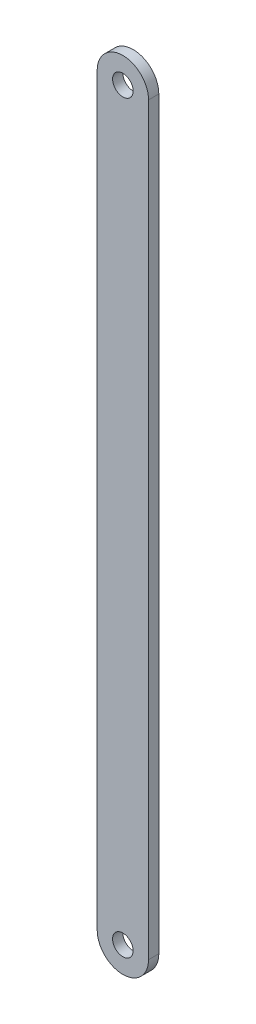
ISO-10303-21;
HEADER;
FILE_DESCRIPTION(('STEP AP214'),'2;1');
FILE_NAME('part.step','',(''),(''),'','','');
FILE_SCHEMA(('AUTOMOTIVE_DESIGN { 1 0 10303 214 1 1 1 1 }'));
ENDSEC;
DATA;
#1=APPLICATION_CONTEXT('core data for automotive mechanical design processes');
#2=APPLICATION_PROTOCOL_DEFINITION('international standard','automotive_design',2000,#1);
#3=PRODUCT_CONTEXT('',#1,'mechanical');
#4=PRODUCT('Part','Part','',(#3));
#5=PRODUCT_RELATED_PRODUCT_CATEGORY('part','',(#4));
#6=PRODUCT_DEFINITION_FORMATION('','',#4);
#7=PRODUCT_DEFINITION_CONTEXT('part definition',#1,'design');
#8=PRODUCT_DEFINITION('design','',#6,#7);
#9=PRODUCT_DEFINITION_SHAPE('','',#8);
#10=(LENGTH_UNIT() NAMED_UNIT(*) SI_UNIT(.MILLI.,.METRE.));
#11=(NAMED_UNIT(*) PLANE_ANGLE_UNIT() SI_UNIT($,.RADIAN.));
#12=(NAMED_UNIT(*) SI_UNIT($,.STERADIAN.) SOLID_ANGLE_UNIT());
#13=UNCERTAINTY_MEASURE_WITH_UNIT(LENGTH_MEASURE(1.E-05),#10,'distance_accuracy_value','');
#14=(GEOMETRIC_REPRESENTATION_CONTEXT(3) GLOBAL_UNCERTAINTY_ASSIGNED_CONTEXT((#13)) GLOBAL_UNIT_ASSIGNED_CONTEXT((#10,
#11,#12)) REPRESENTATION_CONTEXT('',''));
#15=CARTESIAN_POINT('',(0.,0.,0.));
#16=DIRECTION('',(0.,0.,1.));
#17=DIRECTION('',(1.,0.,0.));
#18=AXIS2_PLACEMENT_3D('',#15,#16,#17);
#19=CARTESIAN_POINT('',(0.,-72.5,2.));
#20=DIRECTION('',(0.,0.,1.));
#21=DIRECTION('',(1.,0.,0.));
#22=AXIS2_PLACEMENT_3D('',#19,#20,#21);
#23=PLANE('',#22);
#24=CARTESIAN_POINT('',(0.,72.5,2.));
#25=DIRECTION('',(0.,0.,1.));
#26=DIRECTION('',(1.,0.,0.));
#27=AXIS2_PLACEMENT_3D('',#24,#25,#26);
#28=CIRCLE('',#27,2.);
#29=CARTESIAN_POINT('',(1.99999999999997,72.5,2.));
#30=VERTEX_POINT('',#29);
#31=EDGE_CURVE('E83',#30,#30,#28,.T.);
#32=ORIENTED_EDGE('',*,*,#31,.F.);
#33=EDGE_LOOP('',(#32));
#34=FACE_BOUND('',#33,.T.);
#35=CARTESIAN_POINT('',(0.,-72.5,2.));
#36=DIRECTION('',(0.,0.,1.));
#37=DIRECTION('',(1.,0.,0.));
#38=AXIS2_PLACEMENT_3D('',#35,#36,#37);
#39=CIRCLE('',#38,5.);
#40=CARTESIAN_POINT('',(-5.,-72.5,2.));
#41=VERTEX_POINT('',#40);
#42=CARTESIAN_POINT('',(5.,-72.5,2.));
#43=VERTEX_POINT('',#42);
#44=EDGE_CURVE('E68',#41,#43,#39,.T.);
#45=ORIENTED_EDGE('',*,*,#44,.T.);
#46=DIRECTION('',(0.,1.,0.));
#47=VECTOR('',#46,1.);
#48=CARTESIAN_POINT('',(5.,-72.5,2.));
#49=LINE('',#48,#47);
#50=CARTESIAN_POINT('',(5.,72.5,2.));
#51=VERTEX_POINT('',#50);
#52=EDGE_CURVE('E63',#43,#51,#49,.T.);
#53=ORIENTED_EDGE('',*,*,#52,.T.);
#54=CARTESIAN_POINT('',(0.,72.5,2.));
#55=DIRECTION('',(0.,0.,1.));
#56=DIRECTION('',(1.,0.,0.));
#57=AXIS2_PLACEMENT_3D('',#54,#55,#56);
#58=CIRCLE('',#57,5.);
#59=CARTESIAN_POINT('',(-5.00000000000006,72.5,2.));
#60=VERTEX_POINT('',#59);
#61=EDGE_CURVE('E66',#51,#60,#58,.T.);
#62=ORIENTED_EDGE('',*,*,#61,.T.);
#63=DIRECTION('',(0.,-1.,0.));
#64=VECTOR('',#63,1.);
#65=CARTESIAN_POINT('',(-5.,-72.5,2.));
#66=LINE('',#65,#64);
#67=EDGE_CURVE('E33',#60,#41,#66,.T.);
#68=ORIENTED_EDGE('',*,*,#67,.T.);
#69=EDGE_LOOP('',(#45,#53,#62,#68));
#70=FACE_BOUND('',#69,.T.);
#71=CARTESIAN_POINT('',(0.,-72.5,2.));
#72=DIRECTION('',(0.,0.,1.));
#73=DIRECTION('',(1.,0.,0.));
#74=AXIS2_PLACEMENT_3D('',#71,#72,#73);
#75=CIRCLE('',#74,2.);
#76=CARTESIAN_POINT('',(2.00000000000003,-72.5,2.));
#77=VERTEX_POINT('',#76);
#78=EDGE_CURVE('E98',#77,#77,#75,.T.);
#79=ORIENTED_EDGE('',*,*,#78,.F.);
#80=EDGE_LOOP('',(#79));
#81=FACE_BOUND('',#80,.T.);
#82=ADVANCED_FACE('F16',(#34,#70,#81),#23,.T.);
#83=CARTESIAN_POINT('',(0.,-72.5,0.));
#84=DIRECTION('',(0.,0.,1.));
#85=DIRECTION('',(1.,0.,0.));
#86=AXIS2_PLACEMENT_3D('',#83,#84,#85);
#87=PLANE('',#86);
#88=CARTESIAN_POINT('',(0.,72.5,0.));
#89=DIRECTION('',(0.,0.,1.));
#90=DIRECTION('',(1.,0.,0.));
#91=AXIS2_PLACEMENT_3D('',#88,#89,#90);
#92=CIRCLE('',#91,2.);
#93=CARTESIAN_POINT('',(1.99999999999997,72.5,0.));
#94=VERTEX_POINT('',#93);
#95=EDGE_CURVE('E95',#94,#94,#92,.T.);
#96=ORIENTED_EDGE('',*,*,#95,.T.);
#97=EDGE_LOOP('',(#96));
#98=FACE_BOUND('',#97,.T.);
#99=CARTESIAN_POINT('',(0.,-72.5,0.));
#100=DIRECTION('',(0.,0.,1.));
#101=DIRECTION('',(1.,0.,0.));
#102=AXIS2_PLACEMENT_3D('',#99,#100,#101);
#103=CIRCLE('',#102,5.);
#104=CARTESIAN_POINT('',(-5.,-72.5,0.));
#105=VERTEX_POINT('',#104);
#106=CARTESIAN_POINT('',(5.,-72.5,0.));
#107=VERTEX_POINT('',#106);
#108=EDGE_CURVE('E80',#105,#107,#103,.T.);
#109=ORIENTED_EDGE('',*,*,#108,.F.);
#110=DIRECTION('',(0.,-1.,0.));
#111=VECTOR('',#110,1.);
#112=CARTESIAN_POINT('',(-5.,-72.5,0.));
#113=LINE('',#112,#111);
#114=CARTESIAN_POINT('',(-5.00000000000006,72.5,0.));
#115=VERTEX_POINT('',#114);
#116=EDGE_CURVE('E56',#115,#105,#113,.T.);
#117=ORIENTED_EDGE('',*,*,#116,.F.);
#118=CARTESIAN_POINT('',(0.,72.5,0.));
#119=DIRECTION('',(0.,0.,1.));
#120=DIRECTION('',(1.,0.,0.));
#121=AXIS2_PLACEMENT_3D('',#118,#119,#120);
#122=CIRCLE('',#121,5.);
#123=CARTESIAN_POINT('',(5.,72.5,0.));
#124=VERTEX_POINT('',#123);
#125=EDGE_CURVE('E50',#124,#115,#122,.T.);
#126=ORIENTED_EDGE('',*,*,#125,.F.);
#127=DIRECTION('',(0.,1.,0.));
#128=VECTOR('',#127,1.);
#129=CARTESIAN_POINT('',(5.,-72.5,0.));
#130=LINE('',#129,#128);
#131=EDGE_CURVE('E72',#107,#124,#130,.T.);
#132=ORIENTED_EDGE('',*,*,#131,.F.);
#133=EDGE_LOOP('',(#109,#117,#126,#132));
#134=FACE_BOUND('',#133,.T.);
#135=CARTESIAN_POINT('',(0.,-72.5,0.));
#136=DIRECTION('',(0.,0.,1.));
#137=DIRECTION('',(1.,0.,0.));
#138=AXIS2_PLACEMENT_3D('',#135,#136,#137);
#139=CIRCLE('',#138,2.);
#140=CARTESIAN_POINT('',(2.00000000000003,-72.5,0.));
#141=VERTEX_POINT('',#140);
#142=EDGE_CURVE('E101',#141,#141,#139,.T.);
#143=ORIENTED_EDGE('',*,*,#142,.T.);
#144=EDGE_LOOP('',(#143));
#145=FACE_BOUND('',#144,.T.);
#146=ADVANCED_FACE('F91',(#98,#134,#145),#87,.F.);
#147=CARTESIAN_POINT('',(0.,-72.5,2.));
#148=DIRECTION('',(0.,0.,-1.));
#149=DIRECTION('',(-1.,0.,0.));
#150=AXIS2_PLACEMENT_3D('',#147,#148,#149);
#151=CYLINDRICAL_SURFACE('',#150,5.);
#152=ORIENTED_EDGE('',*,*,#108,.T.);
#153=DIRECTION('',(0.,0.,-1.));
#154=VECTOR('',#153,1.);
#155=CARTESIAN_POINT('',(5.,-72.5,2.));
#156=LINE('',#155,#154);
#157=EDGE_CURVE('E11',#43,#107,#156,.T.);
#158=ORIENTED_EDGE('',*,*,#157,.F.);
#159=ORIENTED_EDGE('',*,*,#44,.F.);
#160=DIRECTION('',(0.,0.,-1.));
#161=VECTOR('',#160,1.);
#162=CARTESIAN_POINT('',(-5.,-72.5,2.));
#163=LINE('',#162,#161);
#164=EDGE_CURVE('E76',#41,#105,#163,.T.);
#165=ORIENTED_EDGE('',*,*,#164,.T.);
#166=EDGE_LOOP('',(#152,#158,#159,#165));
#167=FACE_BOUND('',#166,.T.);
#168=ADVANCED_FACE('F18',(#167),#151,.T.);
#169=CARTESIAN_POINT('',(5.,-72.5,2.));
#170=DIRECTION('',(-1.,0.,0.));
#171=DIRECTION('',(0.,-1.,0.));
#172=AXIS2_PLACEMENT_3D('',#169,#170,#171);
#173=PLANE('',#172);
#174=ORIENTED_EDGE('',*,*,#131,.T.);
#175=DIRECTION('',(0.,0.,-1.));
#176=VECTOR('',#175,1.);
#177=CARTESIAN_POINT('',(5.,72.5,2.));
#178=LINE('',#177,#176);
#179=EDGE_CURVE('E25',#51,#124,#178,.T.);
#180=ORIENTED_EDGE('',*,*,#179,.F.);
#181=ORIENTED_EDGE('',*,*,#52,.F.);
#182=ORIENTED_EDGE('',*,*,#157,.T.);
#183=EDGE_LOOP('',(#174,#180,#181,#182));
#184=FACE_BOUND('',#183,.T.);
#185=ADVANCED_FACE('F71',(#184),#173,.F.);
#186=CARTESIAN_POINT('',(0.,72.5,2.));
#187=DIRECTION('',(0.,0.,-1.));
#188=DIRECTION('',(-1.,0.,0.));
#189=AXIS2_PLACEMENT_3D('',#186,#187,#188);
#190=CYLINDRICAL_SURFACE('',#189,5.);
#191=ORIENTED_EDGE('',*,*,#125,.T.);
#192=DIRECTION('',(0.,0.,-1.));
#193=VECTOR('',#192,1.);
#194=CARTESIAN_POINT('',(-5.00000000000006,72.5,2.));
#195=LINE('',#194,#193);
#196=EDGE_CURVE('E73',#60,#115,#195,.T.);
#197=ORIENTED_EDGE('',*,*,#196,.F.);
#198=ORIENTED_EDGE('',*,*,#61,.F.);
#199=ORIENTED_EDGE('',*,*,#179,.T.);
#200=EDGE_LOOP('',(#191,#197,#198,#199));
#201=FACE_BOUND('',#200,.T.);
#202=ADVANCED_FACE('F74',(#201),#190,.T.);
#203=CARTESIAN_POINT('',(-5.,-72.5,2.));
#204=DIRECTION('',(1.,0.,0.));
#205=DIRECTION('',(0.,1.,0.));
#206=AXIS2_PLACEMENT_3D('',#203,#204,#205);
#207=PLANE('',#206);
#208=ORIENTED_EDGE('',*,*,#116,.T.);
#209=ORIENTED_EDGE('',*,*,#164,.F.);
#210=ORIENTED_EDGE('',*,*,#67,.F.);
#211=ORIENTED_EDGE('',*,*,#196,.T.);
#212=EDGE_LOOP('',(#208,#209,#210,#211));
#213=FACE_BOUND('',#212,.T.);
#214=ADVANCED_FACE('F88',(#213),#207,.F.);
#215=CARTESIAN_POINT('',(0.,72.5,2.));
#216=DIRECTION('',(0.,0.,-1.));
#217=DIRECTION('',(-1.,0.,0.));
#218=AXIS2_PLACEMENT_3D('',#215,#216,#217);
#219=CYLINDRICAL_SURFACE('',#218,2.);
#220=ORIENTED_EDGE('',*,*,#31,.T.);
#221=EDGE_LOOP('',(#220));
#222=FACE_BOUND('',#221,.T.);
#223=ORIENTED_EDGE('',*,*,#95,.F.);
#224=EDGE_LOOP('',(#223));
#225=FACE_BOUND('',#224,.T.);
#226=ADVANCED_FACE('F121',(#222,#225),#219,.F.);
#227=CARTESIAN_POINT('',(0.,-72.5,2.));
#228=DIRECTION('',(0.,0.,-1.));
#229=DIRECTION('',(-1.,0.,0.));
#230=AXIS2_PLACEMENT_3D('',#227,#228,#229);
#231=CYLINDRICAL_SURFACE('',#230,2.);
#232=ORIENTED_EDGE('',*,*,#78,.T.);
#233=EDGE_LOOP('',(#232));
#234=FACE_BOUND('',#233,.T.);
#235=ORIENTED_EDGE('',*,*,#142,.F.);
#236=EDGE_LOOP('',(#235));
#237=FACE_BOUND('',#236,.T.);
#238=ADVANCED_FACE('F107',(#234,#237),#231,.F.);
#239=CLOSED_SHELL('',(#82,#146,#168,#185,#202,#214,#226,#238));
#240=MANIFOLD_SOLID_BREP('B1',#239);
#241=ADVANCED_BREP_SHAPE_REPRESENTATION('',(#18,#240),#14);
#242=SHAPE_DEFINITION_REPRESENTATION(#9,#241);
ENDSEC;
END-ISO-10303-21;
